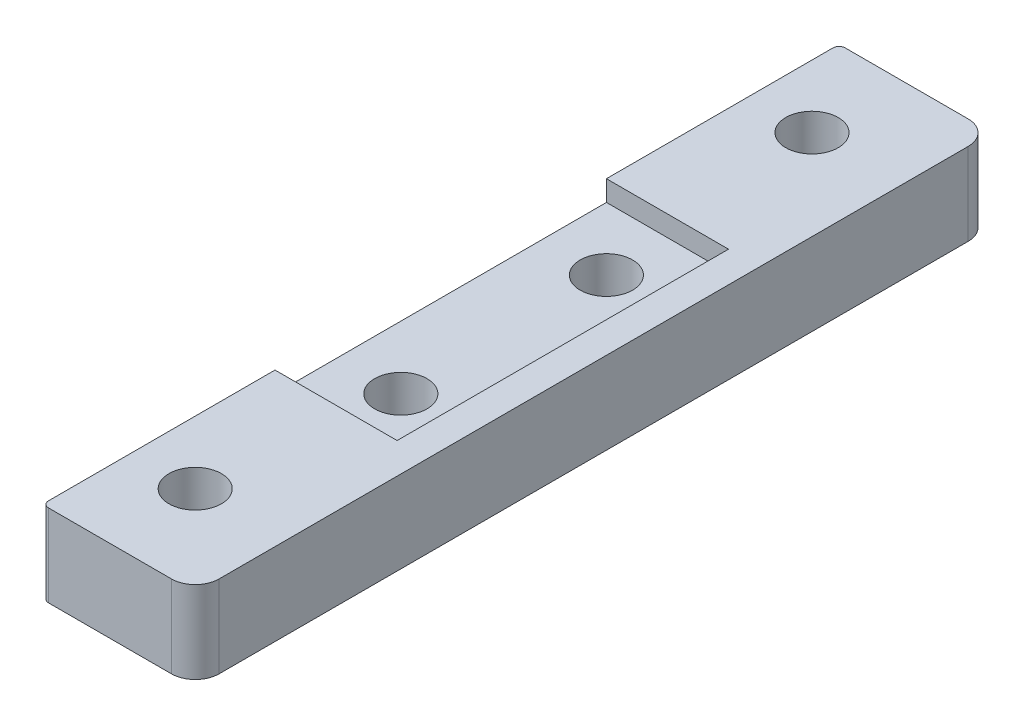
ISO-10303-21;
HEADER;
FILE_DESCRIPTION(('STEP AP214'),'2;1');
FILE_NAME('part.step','',(''),(''),'','','');
FILE_SCHEMA(('AUTOMOTIVE_DESIGN { 1 0 10303 214 1 1 1 1 }'));
ENDSEC;
DATA;
#1=APPLICATION_CONTEXT('core data for automotive mechanical design processes');
#2=APPLICATION_PROTOCOL_DEFINITION('international standard','automotive_design',2000,#1);
#3=PRODUCT_CONTEXT('',#1,'mechanical');
#4=PRODUCT('Part','Part','',(#3));
#5=PRODUCT_RELATED_PRODUCT_CATEGORY('part','',(#4));
#6=PRODUCT_DEFINITION_FORMATION('','',#4);
#7=PRODUCT_DEFINITION_CONTEXT('part definition',#1,'design');
#8=PRODUCT_DEFINITION('design','',#6,#7);
#9=PRODUCT_DEFINITION_SHAPE('','',#8);
#10=(LENGTH_UNIT() NAMED_UNIT(*) SI_UNIT(.MILLI.,.METRE.));
#11=(NAMED_UNIT(*) PLANE_ANGLE_UNIT() SI_UNIT($,.RADIAN.));
#12=(NAMED_UNIT(*) SI_UNIT($,.STERADIAN.) SOLID_ANGLE_UNIT());
#13=UNCERTAINTY_MEASURE_WITH_UNIT(LENGTH_MEASURE(1.E-05),#10,'distance_accuracy_value','');
#14=(GEOMETRIC_REPRESENTATION_CONTEXT(3) GLOBAL_UNCERTAINTY_ASSIGNED_CONTEXT((#13)) GLOBAL_UNIT_ASSIGNED_CONTEXT((#10,
#11,#12)) REPRESENTATION_CONTEXT('',''));
#15=CARTESIAN_POINT('',(0.,0.,0.));
#16=DIRECTION('',(0.,0.,1.));
#17=DIRECTION('',(1.,0.,0.));
#18=AXIS2_PLACEMENT_3D('',#15,#16,#17);
#19=CARTESIAN_POINT('',(-0.465249999999999,8.,-48.7525));
#20=DIRECTION('',(0.,-1.,0.));
#21=DIRECTION('',(0.,0.,-1.));
#22=AXIS2_PLACEMENT_3D('',#19,#20,#21);
#23=CYLINDRICAL_SURFACE('',#22,2.54999999999999);
#24=CARTESIAN_POINT('',(-0.465249999999999,0.,-48.7525));
#25=DIRECTION('',(0.,1.,0.));
#26=DIRECTION('',(0.,0.,1.));
#27=AXIS2_PLACEMENT_3D('',#24,#25,#26);
#28=CIRCLE('',#27,2.54999999999999);
#29=CARTESIAN_POINT('',(-0.465249999999999,0.,-46.2025));
#30=VERTEX_POINT('',#29);
#31=EDGE_CURVE('E203',#30,#30,#28,.T.);
#32=ORIENTED_EDGE('',*,*,#31,.F.);
#33=EDGE_LOOP('',(#32));
#34=FACE_BOUND('',#33,.T.);
#35=CARTESIAN_POINT('',(-0.465249999999999,6.,-48.7525));
#36=DIRECTION('',(0.,1.,0.));
#37=DIRECTION('',(0.,0.,1.));
#38=AXIS2_PLACEMENT_3D('',#35,#36,#37);
#39=CIRCLE('',#38,2.54999999999999);
#40=CARTESIAN_POINT('',(-0.465249999999999,6.,-46.2025));
#41=VERTEX_POINT('',#40);
#42=EDGE_CURVE('E217',#41,#41,#39,.T.);
#43=ORIENTED_EDGE('',*,*,#42,.T.);
#44=EDGE_LOOP('',(#43));
#45=FACE_BOUND('',#44,.T.);
#46=ADVANCED_FACE('F33',(#34,#45),#23,.F.);
#47=CARTESIAN_POINT('',(-0.465249999999999,8.,-28.7525));
#48=DIRECTION('',(0.,-1.,0.));
#49=DIRECTION('',(0.,0.,-1.));
#50=AXIS2_PLACEMENT_3D('',#47,#48,#49);
#51=CYLINDRICAL_SURFACE('',#50,2.55);
#52=CARTESIAN_POINT('',(-0.465249999999999,0.,-28.7525));
#53=DIRECTION('',(0.,1.,0.));
#54=DIRECTION('',(0.,0.,-1.));
#55=AXIS2_PLACEMENT_3D('',#52,#53,#54);
#56=CIRCLE('',#55,2.55);
#57=CARTESIAN_POINT('',(-0.465249999999999,0.,-31.3025));
#58=VERTEX_POINT('',#57);
#59=EDGE_CURVE('E212',#58,#58,#56,.T.);
#60=ORIENTED_EDGE('',*,*,#59,.F.);
#61=EDGE_LOOP('',(#60));
#62=FACE_BOUND('',#61,.T.);
#63=CARTESIAN_POINT('',(-0.465249999999999,6.,-28.7525));
#64=DIRECTION('',(0.,1.,0.));
#65=DIRECTION('',(0.,0.,1.));
#66=AXIS2_PLACEMENT_3D('',#63,#64,#65);
#67=CIRCLE('',#66,2.55);
#68=CARTESIAN_POINT('',(-0.465249999999999,6.,-26.2025));
#69=VERTEX_POINT('',#68);
#70=EDGE_CURVE('E37',#69,#69,#67,.T.);
#71=ORIENTED_EDGE('',*,*,#70,.T.);
#72=EDGE_LOOP('',(#71));
#73=FACE_BOUND('',#72,.T.);
#74=ADVANCED_FACE('F290',(#62,#73),#51,.F.);
#75=CARTESIAN_POINT('',(-5.97725,8.,-76.9));
#76=DIRECTION('',(0.,1.,0.));
#77=DIRECTION('',(0.,0.,1.));
#78=AXIS2_PLACEMENT_3D('',#75,#76,#77);
#79=PLANE('',#78);
#80=DIRECTION('',(-1.,0.,0.));
#81=VECTOR('',#80,1.);
#82=CARTESIAN_POINT('',(-6.58225,8.,-54.8725));
#83=LINE('',#82,#81);
#84=CARTESIAN_POINT('',(5.29474999999999,8.,-54.8725));
#85=VERTEX_POINT('',#84);
#86=CARTESIAN_POINT('',(-6.58225,8.,-54.8725));
#87=VERTEX_POINT('',#86);
#88=EDGE_CURVE('E231',#85,#87,#83,.T.);
#89=ORIENTED_EDGE('',*,*,#88,.F.);
#90=DIRECTION('',(0.,0.,-1.));
#91=VECTOR('',#90,1.);
#92=CARTESIAN_POINT('',(5.29474999999999,8.,-54.8725));
#93=LINE('',#92,#91);
#94=CARTESIAN_POINT('',(5.29474999999999,8.,-22.6325));
#95=VERTEX_POINT('',#94);
#96=EDGE_CURVE('E235',#95,#85,#93,.T.);
#97=ORIENTED_EDGE('',*,*,#96,.F.);
#98=DIRECTION('',(1.,0.,0.));
#99=VECTOR('',#98,1.);
#100=CARTESIAN_POINT('',(-6.58225,8.,-22.6325));
#101=LINE('',#100,#99);
#102=CARTESIAN_POINT('',(-6.58225,8.,-22.6325));
#103=VERTEX_POINT('',#102);
#104=EDGE_CURVE('E238',#103,#95,#101,.T.);
#105=ORIENTED_EDGE('',*,*,#104,.F.);
#106=DIRECTION('',(0.,0.,1.));
#107=VECTOR('',#106,1.);
#108=CARTESIAN_POINT('',(-6.58225,8.,-0.605000000000001));
#109=LINE('',#108,#107);
#110=CARTESIAN_POINT('',(-6.58225,8.,-0.605000000000001));
#111=VERTEX_POINT('',#110);
#112=EDGE_CURVE('E198',#103,#111,#109,.T.);
#113=ORIENTED_EDGE('',*,*,#112,.T.);
#114=CARTESIAN_POINT('',(-5.97725,8.,-0.605000000000001));
#115=DIRECTION('',(0.,1.,0.));
#116=DIRECTION('',(0.,0.,1.));
#117=AXIS2_PLACEMENT_3D('',#114,#115,#116);
#118=CIRCLE('',#117,0.605000000000001);
#119=CARTESIAN_POINT('',(-5.97725,8.,0.));
#120=VERTEX_POINT('',#119);
#121=EDGE_CURVE('E179',#111,#120,#118,.T.);
#122=ORIENTED_EDGE('',*,*,#121,.T.);
#123=DIRECTION('',(1.,0.,0.));
#124=VECTOR('',#123,1.);
#125=CARTESIAN_POINT('',(-5.97725,8.,0.));
#126=LINE('',#125,#124);
#127=CARTESIAN_POINT('',(5.97725,8.,0.));
#128=VERTEX_POINT('',#127);
#129=EDGE_CURVE('E193',#120,#128,#126,.T.);
#130=ORIENTED_EDGE('',*,*,#129,.T.);
#131=CARTESIAN_POINT('',(5.97725,8.,-2.3175));
#132=DIRECTION('',(0.,1.,0.));
#133=DIRECTION('',(0.,0.,1.));
#134=AXIS2_PLACEMENT_3D('',#131,#132,#133);
#135=CIRCLE('',#134,2.3175);
#136=CARTESIAN_POINT('',(8.29475,8.,-2.3175));
#137=VERTEX_POINT('',#136);
#138=EDGE_CURVE('E125',#128,#137,#135,.T.);
#139=ORIENTED_EDGE('',*,*,#138,.T.);
#140=DIRECTION('',(0.,0.,-1.));
#141=VECTOR('',#140,1.);
#142=CARTESIAN_POINT('',(8.29475,8.,-2.3175));
#143=LINE('',#142,#141);
#144=CARTESIAN_POINT('',(8.29475,8.,-75.1875));
#145=VERTEX_POINT('',#144);
#146=EDGE_CURVE('E116',#137,#145,#143,.T.);
#147=ORIENTED_EDGE('',*,*,#146,.T.);
#148=CARTESIAN_POINT('',(5.97725,8.,-75.1875));
#149=DIRECTION('',(0.,1.,0.));
#150=DIRECTION('',(0.,0.,1.));
#151=AXIS2_PLACEMENT_3D('',#148,#149,#150);
#152=CIRCLE('',#151,2.3175);
#153=CARTESIAN_POINT('',(5.97725,8.,-77.505));
#154=VERTEX_POINT('',#153);
#155=EDGE_CURVE('E122',#145,#154,#152,.T.);
#156=ORIENTED_EDGE('',*,*,#155,.T.);
#157=DIRECTION('',(-1.,0.,0.));
#158=VECTOR('',#157,1.);
#159=CARTESIAN_POINT('',(-5.97725,8.,-77.505));
#160=LINE('',#159,#158);
#161=CARTESIAN_POINT('',(-5.97725,8.,-77.505));
#162=VERTEX_POINT('',#161);
#163=EDGE_CURVE('E58',#154,#162,#160,.T.);
#164=ORIENTED_EDGE('',*,*,#163,.T.);
#165=CARTESIAN_POINT('',(-5.97725,8.,-76.9));
#166=DIRECTION('',(0.,1.,0.));
#167=DIRECTION('',(0.,0.,1.));
#168=AXIS2_PLACEMENT_3D('',#165,#166,#167);
#169=CIRCLE('',#168,0.605000000000005);
#170=CARTESIAN_POINT('',(-6.58225,8.,-76.9));
#171=VERTEX_POINT('',#170);
#172=EDGE_CURVE('E162',#162,#171,#169,.T.);
#173=ORIENTED_EDGE('',*,*,#172,.T.);
#174=EDGE_CURVE('E99',#171,#87,#109,.T.);
#175=ORIENTED_EDGE('',*,*,#174,.T.);
#176=EDGE_LOOP('',(#89,#97,#105,#113,#122,#130,#139,#147,#156,#164,#173,#175));
#177=FACE_BOUND('',#176,.T.);
#178=CARTESIAN_POINT('',(-0.465250000000001,8.,-8.7525));
#179=DIRECTION('',(0.,1.,0.));
#180=DIRECTION('',(0.,0.,-1.));
#181=AXIS2_PLACEMENT_3D('',#178,#179,#180);
#182=CIRCLE('',#181,2.55);
#183=CARTESIAN_POINT('',(-0.465250000000001,8.,-11.3025));
#184=VERTEX_POINT('',#183);
#185=EDGE_CURVE('E208',#184,#184,#182,.T.);
#186=ORIENTED_EDGE('',*,*,#185,.F.);
#187=EDGE_LOOP('',(#186));
#188=FACE_BOUND('',#187,.T.);
#189=CARTESIAN_POINT('',(-0.465250000000001,8.,-68.7525));
#190=DIRECTION('',(0.,1.,0.));
#191=DIRECTION('',(0.,0.,1.));
#192=AXIS2_PLACEMENT_3D('',#189,#190,#191);
#193=CIRCLE('',#192,2.54999999999999);
#194=CARTESIAN_POINT('',(-0.465250000000001,8.,-66.2025));
#195=VERTEX_POINT('',#194);
#196=EDGE_CURVE('E150',#195,#195,#193,.T.);
#197=ORIENTED_EDGE('',*,*,#196,.F.);
#198=EDGE_LOOP('',(#197));
#199=FACE_BOUND('',#198,.T.);
#200=ADVANCED_FACE('F119',(#177,#188,#199),#79,.T.);
#201=CARTESIAN_POINT('',(-5.97725,0.,-76.9));
#202=DIRECTION('',(0.,1.,0.));
#203=DIRECTION('',(0.,0.,1.));
#204=AXIS2_PLACEMENT_3D('',#201,#202,#203);
#205=PLANE('',#204);
#206=CARTESIAN_POINT('',(-5.97725,0.,-76.9));
#207=DIRECTION('',(0.,1.,0.));
#208=DIRECTION('',(0.,0.,1.));
#209=AXIS2_PLACEMENT_3D('',#206,#207,#208);
#210=CIRCLE('',#209,0.605000000000005);
#211=CARTESIAN_POINT('',(-5.97725,0.,-77.505));
#212=VERTEX_POINT('',#211);
#213=CARTESIAN_POINT('',(-6.58225,0.,-76.9));
#214=VERTEX_POINT('',#213);
#215=EDGE_CURVE('E146',#212,#214,#210,.T.);
#216=ORIENTED_EDGE('',*,*,#215,.F.);
#217=DIRECTION('',(-1.,0.,0.));
#218=VECTOR('',#217,1.);
#219=CARTESIAN_POINT('',(-5.97725,0.,-77.505));
#220=LINE('',#219,#218);
#221=CARTESIAN_POINT('',(5.97725,0.,-77.505));
#222=VERTEX_POINT('',#221);
#223=EDGE_CURVE('E91',#222,#212,#220,.T.);
#224=ORIENTED_EDGE('',*,*,#223,.F.);
#225=CARTESIAN_POINT('',(5.97725,0.,-75.1875));
#226=DIRECTION('',(0.,1.,0.));
#227=DIRECTION('',(0.,0.,1.));
#228=AXIS2_PLACEMENT_3D('',#225,#226,#227);
#229=CIRCLE('',#228,2.3175);
#230=CARTESIAN_POINT('',(8.29475,0.,-75.1875));
#231=VERTEX_POINT('',#230);
#232=EDGE_CURVE('E159',#231,#222,#229,.T.);
#233=ORIENTED_EDGE('',*,*,#232,.F.);
#234=DIRECTION('',(0.,0.,-1.));
#235=VECTOR('',#234,1.);
#236=CARTESIAN_POINT('',(8.29475,0.,-2.3175));
#237=LINE('',#236,#235);
#238=CARTESIAN_POINT('',(8.29475,0.,-2.3175));
#239=VERTEX_POINT('',#238);
#240=EDGE_CURVE('E134',#239,#231,#237,.T.);
#241=ORIENTED_EDGE('',*,*,#240,.F.);
#242=CARTESIAN_POINT('',(5.97725,0.,-2.3175));
#243=DIRECTION('',(0.,1.,0.));
#244=DIRECTION('',(0.,0.,1.));
#245=AXIS2_PLACEMENT_3D('',#242,#243,#244);
#246=CIRCLE('',#245,2.3175);
#247=CARTESIAN_POINT('',(5.97725,0.,0.));
#248=VERTEX_POINT('',#247);
#249=EDGE_CURVE('E156',#248,#239,#246,.T.);
#250=ORIENTED_EDGE('',*,*,#249,.F.);
#251=DIRECTION('',(1.,0.,0.));
#252=VECTOR('',#251,1.);
#253=CARTESIAN_POINT('',(-5.97725,0.,0.));
#254=LINE('',#253,#252);
#255=CARTESIAN_POINT('',(-5.97725,0.,0.));
#256=VERTEX_POINT('',#255);
#257=EDGE_CURVE('E154',#256,#248,#254,.T.);
#258=ORIENTED_EDGE('',*,*,#257,.F.);
#259=CARTESIAN_POINT('',(-5.97725,0.,-0.605000000000001));
#260=DIRECTION('',(0.,1.,0.));
#261=DIRECTION('',(0.,0.,1.));
#262=AXIS2_PLACEMENT_3D('',#259,#260,#261);
#263=CIRCLE('',#262,0.605000000000001);
#264=CARTESIAN_POINT('',(-6.58225,0.,-0.605000000000001));
#265=VERTEX_POINT('',#264);
#266=EDGE_CURVE('E152',#265,#256,#263,.T.);
#267=ORIENTED_EDGE('',*,*,#266,.F.);
#268=DIRECTION('',(0.,0.,1.));
#269=VECTOR('',#268,1.);
#270=CARTESIAN_POINT('',(-6.58225,0.,-0.605000000000001));
#271=LINE('',#270,#269);
#272=EDGE_CURVE('E149',#214,#265,#271,.T.);
#273=ORIENTED_EDGE('',*,*,#272,.F.);
#274=EDGE_LOOP('',(#216,#224,#233,#241,#250,#258,#267,#273));
#275=FACE_BOUND('',#274,.T.);
#276=CARTESIAN_POINT('',(-0.465250000000001,0.,-68.7525));
#277=DIRECTION('',(0.,1.,0.));
#278=DIRECTION('',(0.,0.,1.));
#279=AXIS2_PLACEMENT_3D('',#276,#277,#278);
#280=CIRCLE('',#279,2.54999999999999);
#281=CARTESIAN_POINT('',(-0.465250000000001,0.,-66.2025));
#282=VERTEX_POINT('',#281);
#283=EDGE_CURVE('E200',#282,#282,#280,.T.);
#284=ORIENTED_EDGE('',*,*,#283,.T.);
#285=EDGE_LOOP('',(#284));
#286=FACE_BOUND('',#285,.T.);
#287=ORIENTED_EDGE('',*,*,#31,.T.);
#288=EDGE_LOOP('',(#287));
#289=FACE_BOUND('',#288,.T.);
#290=CARTESIAN_POINT('',(-0.465250000000001,0.,-8.7525));
#291=DIRECTION('',(0.,1.,0.));
#292=DIRECTION('',(0.,0.,-1.));
#293=AXIS2_PLACEMENT_3D('',#290,#291,#292);
#294=CIRCLE('',#293,2.55);
#295=CARTESIAN_POINT('',(-0.465250000000001,0.,-11.3025));
#296=VERTEX_POINT('',#295);
#297=EDGE_CURVE('E209',#296,#296,#294,.T.);
#298=ORIENTED_EDGE('',*,*,#297,.T.);
#299=EDGE_LOOP('',(#298));
#300=FACE_BOUND('',#299,.T.);
#301=ORIENTED_EDGE('',*,*,#59,.T.);
#302=EDGE_LOOP('',(#301));
#303=FACE_BOUND('',#302,.T.);
#304=ADVANCED_FACE('F184',(#275,#286,#289,#300,#303),#205,.F.);
#305=CARTESIAN_POINT('',(-5.97725,8.,-76.9));
#306=DIRECTION('',(0.,-1.,0.));
#307=DIRECTION('',(0.,0.,-1.));
#308=AXIS2_PLACEMENT_3D('',#305,#306,#307);
#309=CYLINDRICAL_SURFACE('',#308,0.605000000000005);
#310=ORIENTED_EDGE('',*,*,#215,.T.);
#311=DIRECTION('',(0.,-1.,0.));
#312=VECTOR('',#311,1.);
#313=CARTESIAN_POINT('',(-6.58225,8.,-76.9));
#314=LINE('',#313,#312);
#315=EDGE_CURVE('E11',#171,#214,#314,.T.);
#316=ORIENTED_EDGE('',*,*,#315,.F.);
#317=ORIENTED_EDGE('',*,*,#172,.F.);
#318=DIRECTION('',(0.,-1.,0.));
#319=VECTOR('',#318,1.);
#320=CARTESIAN_POINT('',(-5.97725,8.,-77.505));
#321=LINE('',#320,#319);
#322=EDGE_CURVE('E142',#162,#212,#321,.T.);
#323=ORIENTED_EDGE('',*,*,#322,.T.);
#324=EDGE_LOOP('',(#310,#316,#317,#323));
#325=FACE_BOUND('',#324,.T.);
#326=ADVANCED_FACE('F35',(#325),#309,.T.);
#327=CARTESIAN_POINT('',(-6.58225,8.,-0.605000000000001));
#328=DIRECTION('',(1.,0.,0.));
#329=DIRECTION('',(0.,0.,-1.));
#330=AXIS2_PLACEMENT_3D('',#327,#328,#329);
#331=PLANE('',#330);
#332=DIRECTION('',(0.,0.,1.));
#333=VECTOR('',#332,1.);
#334=CARTESIAN_POINT('',(-6.58225,6.,-54.8725));
#335=LINE('',#334,#333);
#336=CARTESIAN_POINT('',(-6.58225,6.,-54.8725));
#337=VERTEX_POINT('',#336);
#338=CARTESIAN_POINT('',(-6.58225,6.,-22.6325));
#339=VERTEX_POINT('',#338);
#340=EDGE_CURVE('E234',#337,#339,#335,.T.);
#341=ORIENTED_EDGE('',*,*,#340,.F.);
#342=DIRECTION('',(0.,1.,0.));
#343=VECTOR('',#342,1.);
#344=CARTESIAN_POINT('',(-6.58225,6.,-54.8725));
#345=LINE('',#344,#343);
#346=EDGE_CURVE('E229',#337,#87,#345,.T.);
#347=ORIENTED_EDGE('',*,*,#346,.T.);
#348=ORIENTED_EDGE('',*,*,#174,.F.);
#349=ORIENTED_EDGE('',*,*,#315,.T.);
#350=ORIENTED_EDGE('',*,*,#272,.T.);
#351=DIRECTION('',(0.,-1.,0.));
#352=VECTOR('',#351,1.);
#353=CARTESIAN_POINT('',(-6.58225,8.,-0.605000000000001));
#354=LINE('',#353,#352);
#355=EDGE_CURVE('E42',#111,#265,#354,.T.);
#356=ORIENTED_EDGE('',*,*,#355,.F.);
#357=ORIENTED_EDGE('',*,*,#112,.F.);
#358=DIRECTION('',(0.,1.,0.));
#359=VECTOR('',#358,1.);
#360=CARTESIAN_POINT('',(-6.58225,6.,-22.6325));
#361=LINE('',#360,#359);
#362=EDGE_CURVE('E220',#339,#103,#361,.T.);
#363=ORIENTED_EDGE('',*,*,#362,.F.);
#364=EDGE_LOOP('',(#341,#347,#348,#349,#350,#356,#357,#363));
#365=FACE_BOUND('',#364,.T.);
#366=ADVANCED_FACE('F254',(#365),#331,.F.);
#367=CARTESIAN_POINT('',(-5.97725,8.,-0.605000000000001));
#368=DIRECTION('',(0.,-1.,0.));
#369=DIRECTION('',(0.,0.,-1.));
#370=AXIS2_PLACEMENT_3D('',#367,#368,#369);
#371=CYLINDRICAL_SURFACE('',#370,0.605000000000001);
#372=ORIENTED_EDGE('',*,*,#266,.T.);
#373=DIRECTION('',(0.,-1.,0.));
#374=VECTOR('',#373,1.);
#375=CARTESIAN_POINT('',(-5.97725,8.,0.));
#376=LINE('',#375,#374);
#377=EDGE_CURVE('E169',#120,#256,#376,.T.);
#378=ORIENTED_EDGE('',*,*,#377,.F.);
#379=ORIENTED_EDGE('',*,*,#121,.F.);
#380=ORIENTED_EDGE('',*,*,#355,.T.);
#381=EDGE_LOOP('',(#372,#378,#379,#380));
#382=FACE_BOUND('',#381,.T.);
#383=ADVANCED_FACE('F177',(#382),#371,.T.);
#384=CARTESIAN_POINT('',(-5.97725,8.,0.));
#385=DIRECTION('',(0.,0.,-1.));
#386=DIRECTION('',(-1.,0.,0.));
#387=AXIS2_PLACEMENT_3D('',#384,#385,#386);
#388=PLANE('',#387);
#389=ORIENTED_EDGE('',*,*,#257,.T.);
#390=DIRECTION('',(0.,-1.,0.));
#391=VECTOR('',#390,1.);
#392=CARTESIAN_POINT('',(5.97725,8.,0.));
#393=LINE('',#392,#391);
#394=EDGE_CURVE('E166',#128,#248,#393,.T.);
#395=ORIENTED_EDGE('',*,*,#394,.F.);
#396=ORIENTED_EDGE('',*,*,#129,.F.);
#397=ORIENTED_EDGE('',*,*,#377,.T.);
#398=EDGE_LOOP('',(#389,#395,#396,#397));
#399=FACE_BOUND('',#398,.T.);
#400=ADVANCED_FACE('F189',(#399),#388,.F.);
#401=CARTESIAN_POINT('',(5.97725,8.,-2.3175));
#402=DIRECTION('',(0.,-1.,0.));
#403=DIRECTION('',(0.,0.,-1.));
#404=AXIS2_PLACEMENT_3D('',#401,#402,#403);
#405=CYLINDRICAL_SURFACE('',#404,2.3175);
#406=ORIENTED_EDGE('',*,*,#249,.T.);
#407=DIRECTION('',(0.,-1.,0.));
#408=VECTOR('',#407,1.);
#409=CARTESIAN_POINT('',(8.29475,8.,-2.3175));
#410=LINE('',#409,#408);
#411=EDGE_CURVE('E137',#137,#239,#410,.T.);
#412=ORIENTED_EDGE('',*,*,#411,.F.);
#413=ORIENTED_EDGE('',*,*,#138,.F.);
#414=ORIENTED_EDGE('',*,*,#394,.T.);
#415=EDGE_LOOP('',(#406,#412,#413,#414));
#416=FACE_BOUND('',#415,.T.);
#417=ADVANCED_FACE('F192',(#416),#405,.T.);
#418=CARTESIAN_POINT('',(8.29475,8.,-2.3175));
#419=DIRECTION('',(-1.,0.,0.));
#420=DIRECTION('',(0.,0.,1.));
#421=AXIS2_PLACEMENT_3D('',#418,#419,#420);
#422=PLANE('',#421);
#423=ORIENTED_EDGE('',*,*,#240,.T.);
#424=DIRECTION('',(0.,-1.,0.));
#425=VECTOR('',#424,1.);
#426=CARTESIAN_POINT('',(8.29475,8.,-75.1875));
#427=LINE('',#426,#425);
#428=EDGE_CURVE('E131',#145,#231,#427,.T.);
#429=ORIENTED_EDGE('',*,*,#428,.F.);
#430=ORIENTED_EDGE('',*,*,#146,.F.);
#431=ORIENTED_EDGE('',*,*,#411,.T.);
#432=EDGE_LOOP('',(#423,#429,#430,#431));
#433=FACE_BOUND('',#432,.T.);
#434=ADVANCED_FACE('F132',(#433),#422,.F.);
#435=CARTESIAN_POINT('',(5.97725,8.,-75.1875));
#436=DIRECTION('',(0.,-1.,0.));
#437=DIRECTION('',(0.,0.,-1.));
#438=AXIS2_PLACEMENT_3D('',#435,#436,#437);
#439=CYLINDRICAL_SURFACE('',#438,2.3175);
#440=ORIENTED_EDGE('',*,*,#232,.T.);
#441=DIRECTION('',(0.,-1.,0.));
#442=VECTOR('',#441,1.);
#443=CARTESIAN_POINT('',(5.97725,8.,-77.505));
#444=LINE('',#443,#442);
#445=EDGE_CURVE('E138',#154,#222,#444,.T.);
#446=ORIENTED_EDGE('',*,*,#445,.F.);
#447=ORIENTED_EDGE('',*,*,#155,.F.);
#448=ORIENTED_EDGE('',*,*,#428,.T.);
#449=EDGE_LOOP('',(#440,#446,#447,#448));
#450=FACE_BOUND('',#449,.T.);
#451=ADVANCED_FACE('F140',(#450),#439,.T.);
#452=CARTESIAN_POINT('',(-5.97725,8.,-77.505));
#453=DIRECTION('',(0.,0.,1.));
#454=DIRECTION('',(1.,0.,0.));
#455=AXIS2_PLACEMENT_3D('',#452,#453,#454);
#456=PLANE('',#455);
#457=ORIENTED_EDGE('',*,*,#223,.T.);
#458=ORIENTED_EDGE('',*,*,#322,.F.);
#459=ORIENTED_EDGE('',*,*,#163,.F.);
#460=ORIENTED_EDGE('',*,*,#445,.T.);
#461=EDGE_LOOP('',(#457,#458,#459,#460));
#462=FACE_BOUND('',#461,.T.);
#463=ADVANCED_FACE('F276',(#462),#456,.F.);
#464=CARTESIAN_POINT('',(-0.465250000000001,8.,-68.7525));
#465=DIRECTION('',(0.,-1.,0.));
#466=DIRECTION('',(0.,0.,-1.));
#467=AXIS2_PLACEMENT_3D('',#464,#465,#466);
#468=CYLINDRICAL_SURFACE('',#467,2.54999999999999);
#469=ORIENTED_EDGE('',*,*,#196,.T.);
#470=EDGE_LOOP('',(#469));
#471=FACE_BOUND('',#470,.T.);
#472=ORIENTED_EDGE('',*,*,#283,.F.);
#473=EDGE_LOOP('',(#472));
#474=FACE_BOUND('',#473,.T.);
#475=ADVANCED_FACE('F278',(#471,#474),#468,.F.);
#476=CARTESIAN_POINT('',(-0.465250000000001,8.,-8.7525));
#477=DIRECTION('',(0.,-1.,0.));
#478=DIRECTION('',(0.,0.,-1.));
#479=AXIS2_PLACEMENT_3D('',#476,#477,#478);
#480=CYLINDRICAL_SURFACE('',#479,2.55);
#481=ORIENTED_EDGE('',*,*,#185,.T.);
#482=EDGE_LOOP('',(#481));
#483=FACE_BOUND('',#482,.T.);
#484=ORIENTED_EDGE('',*,*,#297,.F.);
#485=EDGE_LOOP('',(#484));
#486=FACE_BOUND('',#485,.T.);
#487=ADVANCED_FACE('F284',(#483,#486),#480,.F.);
#488=CARTESIAN_POINT('',(-6.58225,6.,-54.8725));
#489=DIRECTION('',(0.,0.,-1.));
#490=DIRECTION('',(-1.,0.,0.));
#491=AXIS2_PLACEMENT_3D('',#488,#489,#490);
#492=PLANE('',#491);
#493=ORIENTED_EDGE('',*,*,#88,.T.);
#494=ORIENTED_EDGE('',*,*,#346,.F.);
#495=DIRECTION('',(-1.,0.,0.));
#496=VECTOR('',#495,1.);
#497=CARTESIAN_POINT('',(-6.58225,6.,-54.8725));
#498=LINE('',#497,#496);
#499=CARTESIAN_POINT('',(5.29474999999999,6.,-54.8725));
#500=VERTEX_POINT('',#499);
#501=EDGE_CURVE('E49',#500,#337,#498,.T.);
#502=ORIENTED_EDGE('',*,*,#501,.F.);
#503=DIRECTION('',(0.,1.,0.));
#504=VECTOR('',#503,1.);
#505=CARTESIAN_POINT('',(5.29474999999999,6.,-54.8725));
#506=LINE('',#505,#504);
#507=EDGE_CURVE('E226',#500,#85,#506,.T.);
#508=ORIENTED_EDGE('',*,*,#507,.T.);
#509=EDGE_LOOP('',(#493,#494,#502,#508));
#510=FACE_BOUND('',#509,.T.);
#511=ADVANCED_FACE('F272',(#510),#492,.F.);
#512=CARTESIAN_POINT('',(5.29474999999999,6.,-54.8725));
#513=DIRECTION('',(1.,0.,0.));
#514=DIRECTION('',(0.,0.,-1.));
#515=AXIS2_PLACEMENT_3D('',#512,#513,#514);
#516=PLANE('',#515);
#517=ORIENTED_EDGE('',*,*,#96,.T.);
#518=ORIENTED_EDGE('',*,*,#507,.F.);
#519=DIRECTION('',(0.,0.,-1.));
#520=VECTOR('',#519,1.);
#521=CARTESIAN_POINT('',(5.29474999999999,6.,-54.8725));
#522=LINE('',#521,#520);
#523=CARTESIAN_POINT('',(5.29474999999999,6.,-22.6325));
#524=VERTEX_POINT('',#523);
#525=EDGE_CURVE('E242',#524,#500,#522,.T.);
#526=ORIENTED_EDGE('',*,*,#525,.F.);
#527=DIRECTION('',(0.,1.,0.));
#528=VECTOR('',#527,1.);
#529=CARTESIAN_POINT('',(5.29474999999999,6.,-22.6325));
#530=LINE('',#529,#528);
#531=EDGE_CURVE('E223',#524,#95,#530,.T.);
#532=ORIENTED_EDGE('',*,*,#531,.T.);
#533=EDGE_LOOP('',(#517,#518,#526,#532));
#534=FACE_BOUND('',#533,.T.);
#535=ADVANCED_FACE('F267',(#534),#516,.F.);
#536=CARTESIAN_POINT('',(-6.58225,6.,-22.6325));
#537=DIRECTION('',(0.,0.,1.));
#538=DIRECTION('',(1.,0.,0.));
#539=AXIS2_PLACEMENT_3D('',#536,#537,#538);
#540=PLANE('',#539);
#541=ORIENTED_EDGE('',*,*,#104,.T.);
#542=ORIENTED_EDGE('',*,*,#531,.F.);
#543=DIRECTION('',(1.,0.,0.));
#544=VECTOR('',#543,1.);
#545=CARTESIAN_POINT('',(-6.58225,6.,-22.6325));
#546=LINE('',#545,#544);
#547=EDGE_CURVE('E244',#339,#524,#546,.T.);
#548=ORIENTED_EDGE('',*,*,#547,.F.);
#549=ORIENTED_EDGE('',*,*,#362,.T.);
#550=EDGE_LOOP('',(#541,#542,#548,#549));
#551=FACE_BOUND('',#550,.T.);
#552=ADVANCED_FACE('F258',(#551),#540,.F.);
#553=CARTESIAN_POINT('',(0.,6.,0.));
#554=DIRECTION('',(0.,1.,0.));
#555=DIRECTION('',(0.,0.,1.));
#556=AXIS2_PLACEMENT_3D('',#553,#554,#555);
#557=PLANE('',#556);
#558=ORIENTED_EDGE('',*,*,#42,.F.);
#559=EDGE_LOOP('',(#558));
#560=FACE_BOUND('',#559,.T.);
#561=ORIENTED_EDGE('',*,*,#70,.F.);
#562=EDGE_LOOP('',(#561));
#563=FACE_BOUND('',#562,.T.);
#564=ORIENTED_EDGE('',*,*,#340,.T.);
#565=ORIENTED_EDGE('',*,*,#547,.T.);
#566=ORIENTED_EDGE('',*,*,#525,.T.);
#567=ORIENTED_EDGE('',*,*,#501,.T.);
#568=EDGE_LOOP('',(#564,#565,#566,#567));
#569=FACE_BOUND('',#568,.T.);
#570=ADVANCED_FACE('F250',(#560,#563,#569),#557,.T.);
#571=CLOSED_SHELL('',(#46,#74,#200,#304,#326,#366,#383,#400,#417,#434,#451,#463,#475,#487,#511,
#535,#552,#570));
#572=MANIFOLD_SOLID_BREP('B2',#571);
#573=ADVANCED_BREP_SHAPE_REPRESENTATION('',(#18,#572),#14);
#574=SHAPE_DEFINITION_REPRESENTATION(#9,#573);
ENDSEC;
END-ISO-10303-21;
